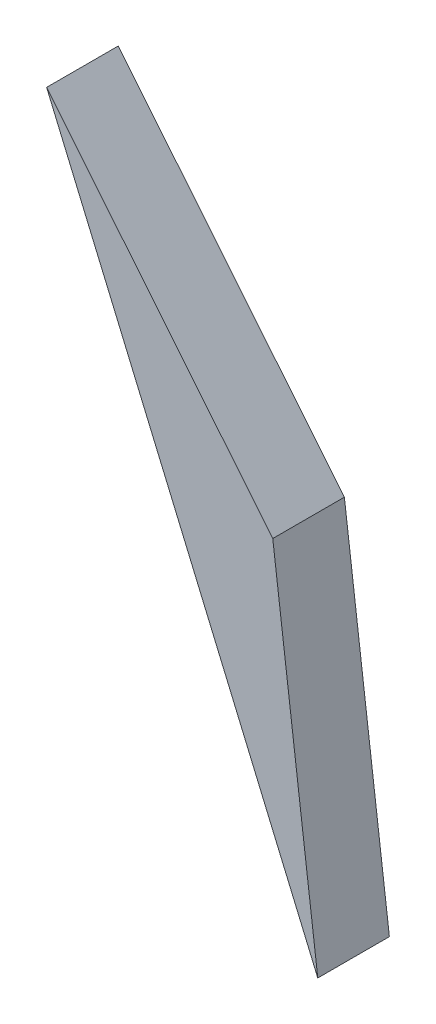
ISO-10303-21;
HEADER;
FILE_DESCRIPTION(('STEP AP214'),'2;1');
FILE_NAME('part.step','',(''),(''),'','','');
FILE_SCHEMA(('AUTOMOTIVE_DESIGN { 1 0 10303 214 1 1 1 1 }'));
ENDSEC;
DATA;
#1=APPLICATION_CONTEXT('core data for automotive mechanical design processes');
#2=APPLICATION_PROTOCOL_DEFINITION('international standard','automotive_design',2000,#1);
#3=PRODUCT_CONTEXT('',#1,'mechanical');
#4=PRODUCT('Part','Part','',(#3));
#5=PRODUCT_RELATED_PRODUCT_CATEGORY('part','',(#4));
#6=PRODUCT_DEFINITION_FORMATION('','',#4);
#7=PRODUCT_DEFINITION_CONTEXT('part definition',#1,'design');
#8=PRODUCT_DEFINITION('design','',#6,#7);
#9=PRODUCT_DEFINITION_SHAPE('','',#8);
#10=(LENGTH_UNIT() NAMED_UNIT(*) SI_UNIT(.MILLI.,.METRE.));
#11=(NAMED_UNIT(*) PLANE_ANGLE_UNIT() SI_UNIT($,.RADIAN.));
#12=(NAMED_UNIT(*) SI_UNIT($,.STERADIAN.) SOLID_ANGLE_UNIT());
#13=UNCERTAINTY_MEASURE_WITH_UNIT(LENGTH_MEASURE(1.E-05),#10,'distance_accuracy_value','');
#14=(GEOMETRIC_REPRESENTATION_CONTEXT(3) GLOBAL_UNCERTAINTY_ASSIGNED_CONTEXT((#13)) GLOBAL_UNIT_ASSIGNED_CONTEXT((#10,
#11,#12)) REPRESENTATION_CONTEXT('',''));
#15=CARTESIAN_POINT('',(0.,0.,0.));
#16=DIRECTION('',(0.,0.,1.));
#17=DIRECTION('',(1.,0.,0.));
#18=AXIS2_PLACEMENT_3D('',#15,#16,#17);
#19=CARTESIAN_POINT('',(-2.86929473980148,-1.22766198215651,3.));
#20=DIRECTION('',(-0.775338824481745,-0.631545491038663,0.));
#21=DIRECTION('',(0.631545491038663,-0.775338824481745,0.));
#22=AXIS2_PLACEMENT_3D('',#19,#20,#21);
#23=PLANE('',#22);
#24=DIRECTION('',(-0.631545491038663,0.775338824481745,0.));
#25=VECTOR('',#24,1.);
#26=CARTESIAN_POINT('',(-2.86929473980148,-1.22766198215651,0.));
#27=LINE('',#26,#25);
#28=CARTESIAN_POINT('',(-2.86929473980148,-1.22766198215651,0.));
#29=VERTEX_POINT('',#28);
#30=CARTESIAN_POINT('',(-12.3424771053814,10.4024203850697,0.));
#31=VERTEX_POINT('',#30);
#32=EDGE_CURVE('E80',#29,#31,#27,.T.);
#33=ORIENTED_EDGE('',*,*,#32,.T.);
#34=DIRECTION('',(0.,0.,-1.));
#35=VECTOR('',#34,1.);
#36=CARTESIAN_POINT('',(-12.3424771053814,10.4024203850697,3.));
#37=LINE('',#36,#35);
#38=CARTESIAN_POINT('',(-12.3424771053814,10.4024203850697,3.));
#39=VERTEX_POINT('',#38);
#40=EDGE_CURVE('E11',#39,#31,#37,.T.);
#41=ORIENTED_EDGE('',*,*,#40,.F.);
#42=DIRECTION('',(-0.631545491038663,0.775338824481745,0.));
#43=VECTOR('',#42,1.);
#44=CARTESIAN_POINT('',(-2.86929473980148,-1.22766198215651,3.));
#45=LINE('',#44,#43);
#46=CARTESIAN_POINT('',(-2.86929473980148,-1.22766198215651,3.));
#47=VERTEX_POINT('',#46);
#48=EDGE_CURVE('E73',#47,#39,#45,.T.);
#49=ORIENTED_EDGE('',*,*,#48,.F.);
#50=DIRECTION('',(0.,0.,-1.));
#51=VECTOR('',#50,1.);
#52=CARTESIAN_POINT('',(-2.86929473980148,-1.22766198215651,3.));
#53=LINE('',#52,#51);
#54=EDGE_CURVE('E81',#47,#29,#53,.T.);
#55=ORIENTED_EDGE('',*,*,#54,.T.);
#56=EDGE_LOOP('',(#33,#41,#49,#55));
#57=FACE_BOUND('',#56,.T.);
#58=ADVANCED_FACE('F33',(#57),#23,.F.);
#59=CARTESIAN_POINT('',(-12.3424771053814,10.4024203850697,3.));
#60=DIRECTION('',(0.91982250341196,0.392334757849664,0.));
#61=DIRECTION('',(-0.392334757849665,0.91982250341196,0.));
#62=AXIS2_PLACEMENT_3D('',#59,#60,#61);
#63=PLANE('',#62);
#64=DIRECTION('',(0.392334757849665,-0.91982250341196,0.));
#65=VECTOR('',#64,1.);
#66=CARTESIAN_POINT('',(-12.3424771053814,10.4024203850697,0.));
#67=LINE('',#66,#65);
#68=CARTESIAN_POINT('',(-0.983865114147063,-16.2276619821565,0.));
#69=VERTEX_POINT('',#68);
#70=EDGE_CURVE('E61',#31,#69,#67,.T.);
#71=ORIENTED_EDGE('',*,*,#70,.T.);
#72=DIRECTION('',(0.,0.,-1.));
#73=VECTOR('',#72,1.);
#74=CARTESIAN_POINT('',(-0.983865114147063,-16.2276619821565,3.));
#75=LINE('',#74,#73);
#76=CARTESIAN_POINT('',(-0.983865114147063,-16.2276619821565,3.));
#77=VERTEX_POINT('',#76);
#78=EDGE_CURVE('E41',#77,#69,#75,.T.);
#79=ORIENTED_EDGE('',*,*,#78,.F.);
#80=DIRECTION('',(0.392334757849665,-0.91982250341196,0.));
#81=VECTOR('',#80,1.);
#82=CARTESIAN_POINT('',(-12.3424771053814,10.4024203850697,3.));
#83=LINE('',#82,#81);
#84=EDGE_CURVE('E69',#39,#77,#83,.T.);
#85=ORIENTED_EDGE('',*,*,#84,.F.);
#86=ORIENTED_EDGE('',*,*,#40,.T.);
#87=EDGE_LOOP('',(#71,#79,#85,#86));
#88=FACE_BOUND('',#87,.T.);
#89=ADVANCED_FACE('F70',(#88),#63,.F.);
#90=CARTESIAN_POINT('',(-0.983865114147063,-16.2276619821565,3.));
#91=DIRECTION('',(-0.992192735918912,-0.124713971910708,0.));
#92=DIRECTION('',(0.124713971910708,-0.992192735918912,0.));
#93=AXIS2_PLACEMENT_3D('',#90,#91,#92);
#94=PLANE('',#93);
#95=DIRECTION('',(-0.124713971910708,0.992192735918912,0.));
#96=VECTOR('',#95,1.);
#97=CARTESIAN_POINT('',(-0.983865114147063,-16.2276619821565,0.));
#98=LINE('',#97,#96);
#99=EDGE_CURVE('E66',#69,#29,#98,.T.);
#100=ORIENTED_EDGE('',*,*,#99,.T.);
#101=ORIENTED_EDGE('',*,*,#54,.F.);
#102=DIRECTION('',(-0.124713971910708,0.992192735918912,0.));
#103=VECTOR('',#102,1.);
#104=CARTESIAN_POINT('',(-0.983865114147063,-16.2276619821565,3.));
#105=LINE('',#104,#103);
#106=EDGE_CURVE('E49',#77,#47,#105,.T.);
#107=ORIENTED_EDGE('',*,*,#106,.F.);
#108=ORIENTED_EDGE('',*,*,#78,.T.);
#109=EDGE_LOOP('',(#100,#101,#107,#108));
#110=FACE_BOUND('',#109,.T.);
#111=ADVANCED_FACE('F88',(#110),#94,.F.);
#112=CARTESIAN_POINT('',(0.,0.,3.));
#113=DIRECTION('',(0.,0.,-1.));
#114=DIRECTION('',(-1.,0.,0.));
#115=AXIS2_PLACEMENT_3D('',#112,#113,#114);
#116=PLANE('',#115);
#117=ORIENTED_EDGE('',*,*,#48,.T.);
#118=ORIENTED_EDGE('',*,*,#84,.T.);
#119=ORIENTED_EDGE('',*,*,#106,.T.);
#120=EDGE_LOOP('',(#117,#118,#119));
#121=FACE_BOUND('',#120,.T.);
#122=ADVANCED_FACE('F76',(#121),#116,.F.);
#123=CARTESIAN_POINT('',(0.,0.,0.));
#124=DIRECTION('',(0.,0.,-1.));
#125=DIRECTION('',(-1.,0.,0.));
#126=AXIS2_PLACEMENT_3D('',#123,#124,#125);
#127=PLANE('',#126);
#128=ORIENTED_EDGE('',*,*,#32,.F.);
#129=ORIENTED_EDGE('',*,*,#99,.F.);
#130=ORIENTED_EDGE('',*,*,#70,.F.);
#131=EDGE_LOOP('',(#128,#129,#130));
#132=FACE_BOUND('',#131,.T.);
#133=ADVANCED_FACE('F89',(#132),#127,.T.);
#134=CLOSED_SHELL('',(#58,#89,#111,#122,#133));
#135=MANIFOLD_SOLID_BREP('B2',#134);
#136=ADVANCED_BREP_SHAPE_REPRESENTATION('',(#18,#135),#14);
#137=SHAPE_DEFINITION_REPRESENTATION(#9,#136);
ENDSEC;
END-ISO-10303-21;
